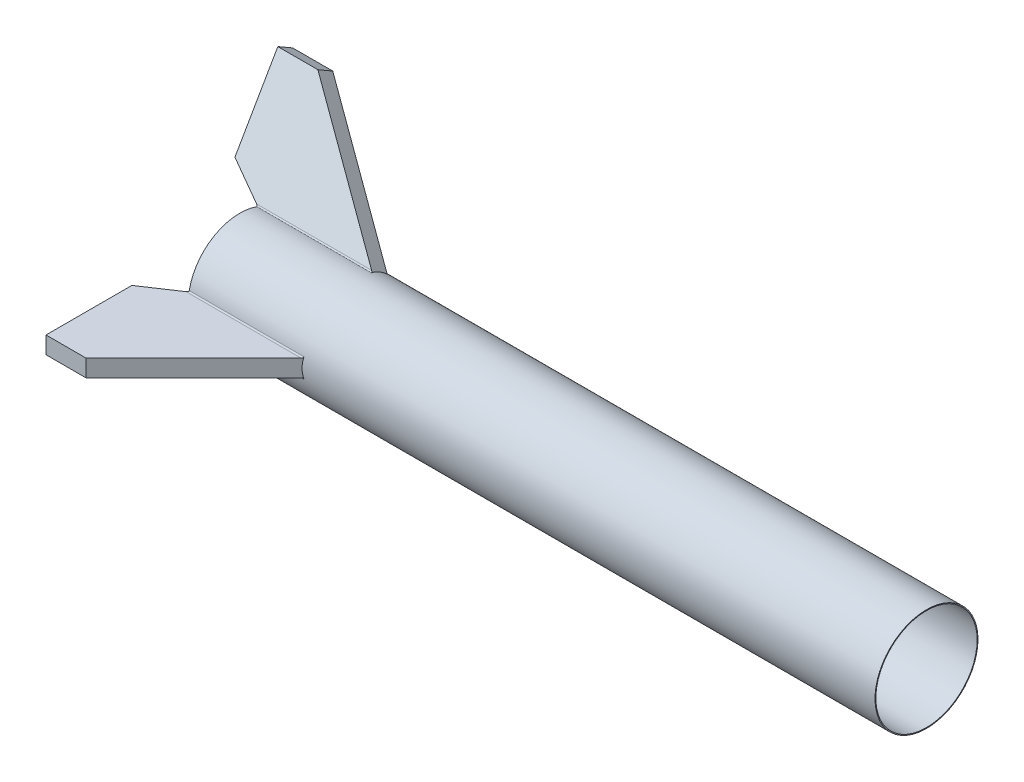
ISO-10303-21;
HEADER;
FILE_DESCRIPTION(('STEP AP214'),'2;1');
FILE_NAME('part.step','',(''),(''),'','','');
FILE_SCHEMA(('AUTOMOTIVE_DESIGN { 1 0 10303 214 1 1 1 1 }'));
ENDSEC;
DATA;
#1=APPLICATION_CONTEXT('core data for automotive mechanical design processes');
#2=APPLICATION_PROTOCOL_DEFINITION('international standard','automotive_design',2000,#1);
#3=PRODUCT_CONTEXT('',#1,'mechanical');
#4=PRODUCT('Part','Part','',(#3));
#5=PRODUCT_RELATED_PRODUCT_CATEGORY('part','',(#4));
#6=PRODUCT_DEFINITION_FORMATION('','',#4);
#7=PRODUCT_DEFINITION_CONTEXT('part definition',#1,'design');
#8=PRODUCT_DEFINITION('design','',#6,#7);
#9=PRODUCT_DEFINITION_SHAPE('','',#8);
#10=(LENGTH_UNIT() NAMED_UNIT(*) SI_UNIT(.MILLI.,.METRE.));
#11=(NAMED_UNIT(*) PLANE_ANGLE_UNIT() SI_UNIT($,.RADIAN.));
#12=(NAMED_UNIT(*) SI_UNIT($,.STERADIAN.) SOLID_ANGLE_UNIT());
#13=UNCERTAINTY_MEASURE_WITH_UNIT(LENGTH_MEASURE(1.E-05),#10,'distance_accuracy_value','');
#14=(GEOMETRIC_REPRESENTATION_CONTEXT(3) GLOBAL_UNCERTAINTY_ASSIGNED_CONTEXT((#13)) GLOBAL_UNIT_ASSIGNED_CONTEXT((#10,
#11,#12)) REPRESENTATION_CONTEXT('',''));
#15=CARTESIAN_POINT('',(0.,0.,0.));
#16=DIRECTION('',(0.,0.,1.));
#17=DIRECTION('',(1.,0.,0.));
#18=AXIS2_PLACEMENT_3D('',#15,#16,#17);
#19=CARTESIAN_POINT('',(-30480.,0.,0.));
#20=DIRECTION('',(1.,0.,0.));
#21=DIRECTION('',(0.,0.,-1.));
#22=AXIS2_PLACEMENT_3D('',#19,#20,#21);
#23=CYLINDRICAL_SURFACE('',#22,4572.);
#24=CARTESIAN_POINT('',(-30480.,0.,0.));
#25=DIRECTION('',(1.,0.,0.));
#26=DIRECTION('',(0.,0.,-1.));
#27=AXIS2_PLACEMENT_3D('',#24,#25,#26);
#28=CIRCLE('',#27,4572.);
#29=CARTESIAN_POINT('',(-30480.,-3455.47625986534,-2993.80490638703));
#30=VERTEX_POINT('',#29);
#31=CARTESIAN_POINT('',(-30480.,3455.47625986538,-2993.80490638698));
#32=VERTEX_POINT('',#31);
#33=EDGE_CURVE('E860',#30,#32,#28,.T.);
#34=ORIENTED_EDGE('',*,*,#33,.T.);
#35=DIRECTION('',(1.,0.,0.));
#36=VECTOR('',#35,1.);
#37=CARTESIAN_POINT('',(-30480.,3455.47625986538,-2993.80490638698));
#38=LINE('',#37,#36);
#39=CARTESIAN_POINT('',(-20301.379881689,3455.47625986538,-2993.80490638698));
#40=VERTEX_POINT('',#39);
#41=EDGE_CURVE('E919',#32,#40,#38,.T.);
#42=ORIENTED_EDGE('',*,*,#41,.T.);
#43=CARTESIAN_POINT('',(-15811.9472052781,0.,0.));
#44=DIRECTION('',(0.707106781186551,0.612372435695794,-0.353553390593266));
#45=DIRECTION('',(0.707106781186544,-0.612372435695801,0.35355339059327));
#46=AXIS2_PLACEMENT_3D('',#43,#44,#45);
#47=ELLIPSE('',#46,6465.78440716975,4572.);
#48=CARTESIAN_POINT('',(-20301.379881689,4320.44923283834,-1495.62777002389));
#49=VERTEX_POINT('',#48);
#50=EDGE_CURVE('E774',#49,#40,#47,.F.);
#51=ORIENTED_EDGE('',*,*,#50,.F.);
#52=DIRECTION('',(1.,0.,0.));
#53=VECTOR('',#52,1.);
#54=CARTESIAN_POINT('',(-30480.,4320.44923283834,-1495.62777002388));
#55=LINE('',#54,#53);
#56=CARTESIAN_POINT('',(-30480.,4320.44923283834,-1495.62777002389));
#57=VERTEX_POINT('',#56);
#58=EDGE_CURVE('E915',#49,#57,#55,.F.);
#59=ORIENTED_EDGE('',*,*,#58,.T.);
#60=CARTESIAN_POINT('',(-30480.,864.972972972973,4489.43267641094));
#61=VERTEX_POINT('',#60);
#62=EDGE_CURVE('E874',#57,#61,#28,.T.);
#63=ORIENTED_EDGE('',*,*,#62,.T.);
#64=DIRECTION('',(1.,0.,0.));
#65=VECTOR('',#64,1.);
#66=CARTESIAN_POINT('',(-30480.,864.972972972973,4489.43267641094));
#67=LINE('',#66,#65);
#68=CARTESIAN_POINT('',(-20301.379881689,864.972972972972,4489.43267641094));
#69=VERTEX_POINT('',#68);
#70=EDGE_CURVE('E849',#61,#69,#67,.T.);
#71=ORIENTED_EDGE('',*,*,#70,.T.);
#72=CARTESIAN_POINT('',(-15811.9472052781,0.,0.));
#73=DIRECTION('',(0.707106781186551,0.,0.707106781186543));
#74=DIRECTION('',(0.707106781186544,0.,-0.707106781186552));
#75=AXIS2_PLACEMENT_3D('',#72,#73,#74);
#76=ELLIPSE('',#75,6465.78440716975,4572.);
#77=CARTESIAN_POINT('',(-20301.379881689,-864.972972972973,4489.43267641094));
#78=VERTEX_POINT('',#77);
#79=EDGE_CURVE('E859',#78,#69,#76,.F.);
#80=ORIENTED_EDGE('',*,*,#79,.F.);
#81=DIRECTION('',(1.,0.,0.));
#82=VECTOR('',#81,1.);
#83=CARTESIAN_POINT('',(-30480.,-864.972972972973,4489.43267641094));
#84=LINE('',#83,#82);
#85=CARTESIAN_POINT('',(-30480.,-864.972972972973,4489.43267641094));
#86=VERTEX_POINT('',#85);
#87=EDGE_CURVE('E852',#78,#86,#84,.F.);
#88=ORIENTED_EDGE('',*,*,#87,.T.);
#89=CARTESIAN_POINT('',(-30480.,-4320.44923283832,-1495.62777002394));
#90=VERTEX_POINT('',#89);
#91=EDGE_CURVE('E855',#86,#90,#28,.T.);
#92=ORIENTED_EDGE('',*,*,#91,.T.);
#93=DIRECTION('',(1.,0.,0.));
#94=VECTOR('',#93,1.);
#95=CARTESIAN_POINT('',(-30480.,-4320.44923283832,-1495.62777002394));
#96=LINE('',#95,#94);
#97=CARTESIAN_POINT('',(-20301.379881689,-4320.44923283832,-1495.62777002394));
#98=VERTEX_POINT('',#97);
#99=EDGE_CURVE('E878',#90,#98,#96,.T.);
#100=ORIENTED_EDGE('',*,*,#99,.T.);
#101=CARTESIAN_POINT('',(-15811.9472052781,0.,0.));
#102=DIRECTION('',(0.707106781186551,-0.612372435695789,-0.353553390593275));
#103=DIRECTION('',(0.707106781186544,0.612372435695796,0.353553390593279));
#104=AXIS2_PLACEMENT_3D('',#101,#102,#103);
#105=ELLIPSE('',#104,6465.78440716975,4572.);
#106=CARTESIAN_POINT('',(-20301.379881689,-3455.47625986534,-2993.80490638703));
#107=VERTEX_POINT('',#106);
#108=EDGE_CURVE('E801',#107,#98,#105,.F.);
#109=ORIENTED_EDGE('',*,*,#108,.F.);
#110=DIRECTION('',(1.,0.,0.));
#111=VECTOR('',#110,1.);
#112=CARTESIAN_POINT('',(-30480.,-3455.47625986534,-2993.80490638703));
#113=LINE('',#112,#111);
#114=EDGE_CURVE('E876',#107,#30,#113,.F.);
#115=ORIENTED_EDGE('',*,*,#114,.T.);
#116=EDGE_LOOP('',(#34,#42,#51,#59,#63,#71,#80,#88,#92,#100,#109,#115));
#117=FACE_BOUND('',#116,.T.);
#118=CARTESIAN_POINT('',(30480.,0.,0.));
#119=DIRECTION('',(1.,0.,0.));
#120=DIRECTION('',(0.,0.,-1.));
#121=AXIS2_PLACEMENT_3D('',#118,#119,#120);
#122=CIRCLE('',#121,4572.);
#123=CARTESIAN_POINT('',(30480.,0.,-4572.));
#124=VERTEX_POINT('',#123);
#125=EDGE_CURVE('E865',#124,#124,#122,.T.);
#126=ORIENTED_EDGE('',*,*,#125,.F.);
#127=EDGE_LOOP('',(#126));
#128=FACE_BOUND('',#127,.T.);
#129=ADVANCED_FACE('F89',(#117,#128),#23,.T.);
#130=CARTESIAN_POINT('',(-30480.,0.,0.));
#131=DIRECTION('',(1.,0.,0.));
#132=DIRECTION('',(0.,0.,-1.));
#133=AXIS2_PLACEMENT_3D('',#130,#131,#132);
#134=PLANE('',#133);
#135=CARTESIAN_POINT('',(-30480.,0.,0.));
#136=DIRECTION('',(1.,0.,0.));
#137=DIRECTION('',(0.,0.,-1.));
#138=AXIS2_PLACEMENT_3D('',#135,#136,#137);
#139=CIRCLE('',#138,4495.8);
#140=CARTESIAN_POINT('',(-30480.,0.,-4495.8));
#141=VERTEX_POINT('',#140);
#142=EDGE_CURVE('E1194',#141,#141,#139,.T.);
#143=ORIENTED_EDGE('',*,*,#142,.T.);
#144=EDGE_LOOP('',(#143));
#145=FACE_BOUND('',#144,.T.);
#146=ORIENTED_EDGE('',*,*,#62,.F.);
#147=CARTESIAN_POINT('',(-30480.,4440.46171152829,-1537.17298585788));
#148=DIRECTION('',(1.,0.,0.));
#149=DIRECTION('',(0.,0.,-1.));
#150=AXIS2_PLACEMENT_3D('',#147,#148,#149);
#151=CIRCLE('',#150,127.);
#152=CARTESIAN_POINT('',(-30480.,4313.67876095168,-1544.59480794472));
#153=VERTEX_POINT('',#152);
#154=EDGE_CURVE('E105',#57,#153,#151,.T.);
#155=ORIENTED_EDGE('',*,*,#154,.T.);
#156=DIRECTION('',(0.,0.499999999999992,0.866025403784443));
#157=VECTOR('',#156,1.);
#158=CARTESIAN_POINT('',(-30480.,3904.08824183063,-2254.02639736092));
#159=LINE('',#158,#157);
#160=CARTESIAN_POINT('',(-30480.,4285.08824183062,-1594.11503967717));
#161=VERTEX_POINT('',#160);
#162=EDGE_CURVE('E13',#161,#153,#159,.T.);
#163=ORIENTED_EDGE('',*,*,#162,.F.);
#164=DIRECTION('',(0.,0.499999999999992,0.866025403784443));
#165=VECTOR('',#164,1.);
#166=CARTESIAN_POINT('',(-30480.,3523.08824183063,-2913.93775504466));
#167=LINE('',#166,#165);
#168=CARTESIAN_POINT('',(-30480.,3523.08824183062,-2913.93775504468));
#169=VERTEX_POINT('',#168);
#170=EDGE_CURVE('E499',#169,#161,#167,.T.);
#171=ORIENTED_EDGE('',*,*,#170,.F.);
#172=DIRECTION('',(0.,-0.499999999999992,-0.866025403784443));
#173=VECTOR('',#172,1.);
#174=CARTESIAN_POINT('',(-30480.,3904.08824183062,-2254.02639736092));
#175=LINE('',#174,#173);
#176=CARTESIAN_POINT('',(-30480.,3494.49772270957,-2963.45798677711));
#177=VERTEX_POINT('',#176);
#178=EDGE_CURVE('E98',#169,#177,#175,.T.);
#179=ORIENTED_EDGE('',*,*,#178,.T.);
#180=CARTESIAN_POINT('',(-30480.,3551.4617115283,-3076.96615378662));
#181=DIRECTION('',(1.,0.,0.));
#182=DIRECTION('',(0.,0.,-1.));
#183=AXIS2_PLACEMENT_3D('',#180,#181,#182);
#184=CIRCLE('',#183,127.);
#185=EDGE_CURVE('E927',#177,#32,#184,.T.);
#186=ORIENTED_EDGE('',*,*,#185,.T.);
#187=ORIENTED_EDGE('',*,*,#33,.F.);
#188=CARTESIAN_POINT('',(-30480.,-3551.46171152826,-3076.96615378667));
#189=DIRECTION('',(1.,0.,0.));
#190=DIRECTION('',(0.,0.,-1.));
#191=AXIS2_PLACEMENT_3D('',#188,#189,#190);
#192=CIRCLE('',#191,127.);
#193=CARTESIAN_POINT('',(-30480.,-3494.49772270952,-2963.45798677716));
#194=VERTEX_POINT('',#193);
#195=EDGE_CURVE('E897',#30,#194,#192,.T.);
#196=ORIENTED_EDGE('',*,*,#195,.T.);
#197=DIRECTION('',(0.,0.500000000000004,-0.866025403784436));
#198=VECTOR('',#197,1.);
#199=CARTESIAN_POINT('',(-30480.,-3904.08824183059,-2254.02639736097));
#200=LINE('',#199,#198);
#201=CARTESIAN_POINT('',(-30480.,-3523.08824183059,-2913.93775504471));
#202=VERTEX_POINT('',#201);
#203=EDGE_CURVE('E908',#202,#194,#200,.T.);
#204=ORIENTED_EDGE('',*,*,#203,.F.);
#205=DIRECTION('',(0.,0.500000000000004,-0.866025403784436));
#206=VECTOR('',#205,1.);
#207=CARTESIAN_POINT('',(-30480.,-4285.0882418306,-1594.11503967723));
#208=LINE('',#207,#206);
#209=CARTESIAN_POINT('',(-30480.,-4285.08824183061,-1594.11503967719));
#210=VERTEX_POINT('',#209);
#211=EDGE_CURVE('E716',#210,#202,#208,.T.);
#212=ORIENTED_EDGE('',*,*,#211,.F.);
#213=DIRECTION('',(0.,-0.500000000000004,0.866025403784436));
#214=VECTOR('',#213,1.);
#215=CARTESIAN_POINT('',(-30480.,-3904.08824183059,-2254.02639736097));
#216=LINE('',#215,#214);
#217=CARTESIAN_POINT('',(-30480.,-4313.67876095166,-1544.59480794477));
#218=VERTEX_POINT('',#217);
#219=EDGE_CURVE('E903',#210,#218,#216,.T.);
#220=ORIENTED_EDGE('',*,*,#219,.T.);
#221=CARTESIAN_POINT('',(-30480.,-4440.46171152827,-1537.17298585794));
#222=DIRECTION('',(1.,0.,0.));
#223=DIRECTION('',(0.,0.,-1.));
#224=AXIS2_PLACEMENT_3D('',#221,#222,#223);
#225=CIRCLE('',#224,127.);
#226=EDGE_CURVE('E887',#218,#90,#225,.T.);
#227=ORIENTED_EDGE('',*,*,#226,.T.);
#228=ORIENTED_EDGE('',*,*,#91,.F.);
#229=CARTESIAN_POINT('',(-30480.,-888.999999999999,4614.13913964458));
#230=DIRECTION('',(1.,0.,0.));
#231=DIRECTION('',(0.,0.,-1.));
#232=AXIS2_PLACEMENT_3D('',#229,#230,#231);
#233=CIRCLE('',#232,127.);
#234=CARTESIAN_POINT('',(-30480.,-819.181038242123,4508.0527947219));
#235=VERTEX_POINT('',#234);
#236=EDGE_CURVE('E826',#86,#235,#233,.T.);
#237=ORIENTED_EDGE('',*,*,#236,.T.);
#238=DIRECTION('',(0.,-1.,0.));
#239=VECTOR('',#238,1.);
#240=CARTESIAN_POINT('',(-30480.,0.,4508.0527947219));
#241=LINE('',#240,#239);
#242=CARTESIAN_POINT('',(-30480.,-762.,4508.05279472191));
#243=VERTEX_POINT('',#242);
#244=EDGE_CURVE('E807',#243,#235,#241,.T.);
#245=ORIENTED_EDGE('',*,*,#244,.F.);
#246=DIRECTION('',(0.,-1.,0.));
#247=VECTOR('',#246,1.);
#248=CARTESIAN_POINT('',(-30480.,762.,4508.05279472191));
#249=LINE('',#248,#247);
#250=CARTESIAN_POINT('',(-30480.,762.000000000028,4508.0527947219));
#251=VERTEX_POINT('',#250);
#252=EDGE_CURVE('E973',#251,#243,#249,.T.);
#253=ORIENTED_EDGE('',*,*,#252,.F.);
#254=DIRECTION('',(0.,1.,0.));
#255=VECTOR('',#254,1.);
#256=CARTESIAN_POINT('',(-30480.,0.,4508.0527947219));
#257=LINE('',#256,#255);
#258=CARTESIAN_POINT('',(-30480.,819.181038242125,4508.0527947219));
#259=VERTEX_POINT('',#258);
#260=EDGE_CURVE('E811',#251,#259,#257,.T.);
#261=ORIENTED_EDGE('',*,*,#260,.T.);
#262=CARTESIAN_POINT('',(-30480.,889.,4614.13913964458));
#263=DIRECTION('',(1.,0.,0.));
#264=DIRECTION('',(0.,0.,-1.));
#265=AXIS2_PLACEMENT_3D('',#262,#263,#264);
#266=CIRCLE('',#265,127.);
#267=EDGE_CURVE('E837',#259,#61,#266,.T.);
#268=ORIENTED_EDGE('',*,*,#267,.T.);
#269=EDGE_LOOP('',(#146,#155,#163,#171,#179,#186,#187,#196,#204,#212,#220,#227,#228,#237,#245,
#253,#261,#268));
#270=FACE_BOUND('',#269,.T.);
#271=ADVANCED_FACE('F775',(#145,#270),#134,.F.);
#272=CARTESIAN_POINT('',(30480.,0.,0.));
#273=DIRECTION('',(1.,0.,0.));
#274=DIRECTION('',(0.,0.,-1.));
#275=AXIS2_PLACEMENT_3D('',#272,#273,#274);
#276=PLANE('',#275);
#277=CARTESIAN_POINT('',(30480.,0.,0.));
#278=DIRECTION('',(1.,0.,0.));
#279=DIRECTION('',(0.,0.,-1.));
#280=AXIS2_PLACEMENT_3D('',#277,#278,#279);
#281=CIRCLE('',#280,4495.8);
#282=CARTESIAN_POINT('',(30480.,0.,-4495.8));
#283=VERTEX_POINT('',#282);
#284=EDGE_CURVE('E977',#283,#283,#281,.T.);
#285=ORIENTED_EDGE('',*,*,#284,.F.);
#286=EDGE_LOOP('',(#285));
#287=FACE_BOUND('',#286,.T.);
#288=ORIENTED_EDGE('',*,*,#125,.T.);
#289=EDGE_LOOP('',(#288));
#290=FACE_BOUND('',#289,.T.);
#291=ADVANCED_FACE('F785',(#287,#290),#276,.T.);
#292=CARTESIAN_POINT('',(-30480.,0.,0.));
#293=DIRECTION('',(1.,0.,0.));
#294=DIRECTION('',(0.,0.,-1.));
#295=AXIS2_PLACEMENT_3D('',#292,#293,#294);
#296=CYLINDRICAL_SURFACE('',#295,4495.8);
#297=ORIENTED_EDGE('',*,*,#142,.F.);
#298=EDGE_LOOP('',(#297));
#299=FACE_BOUND('',#298,.T.);
#300=ORIENTED_EDGE('',*,*,#284,.T.);
#301=EDGE_LOOP('',(#300));
#302=FACE_BOUND('',#301,.T.);
#303=ADVANCED_FACE('F1043',(#299,#302),#296,.F.);
#304=CARTESIAN_POINT('',(-33528.,0.,0.));
#305=DIRECTION('',(-1.,0.,0.));
#306=DIRECTION('',(0.,0.,1.));
#307=AXIS2_PLACEMENT_3D('',#304,#305,#306);
#308=PLANE('',#307);
#309=DIRECTION('',(0.,-1.,0.));
#310=VECTOR('',#309,1.);
#311=CARTESIAN_POINT('',(-33528.,762.,6540.05279472191));
#312=LINE('',#311,#310);
#313=CARTESIAN_POINT('',(-33528.,762.,6540.05279472191));
#314=VERTEX_POINT('',#313);
#315=CARTESIAN_POINT('',(-33528.,-762.,6540.05279472191));
#316=VERTEX_POINT('',#315);
#317=EDGE_CURVE('E767',#314,#316,#312,.T.);
#318=ORIENTED_EDGE('',*,*,#317,.T.);
#319=DIRECTION('',(0.,0.,1.));
#320=VECTOR('',#319,1.);
#321=CARTESIAN_POINT('',(-33528.,-762.,6540.05279472191));
#322=LINE('',#321,#320);
#323=CARTESIAN_POINT('',(-33528.,-762.,14160.0527947219));
#324=VERTEX_POINT('',#323);
#325=EDGE_CURVE('E1135',#316,#324,#322,.T.);
#326=ORIENTED_EDGE('',*,*,#325,.T.);
#327=DIRECTION('',(0.,1.,0.));
#328=VECTOR('',#327,1.);
#329=CARTESIAN_POINT('',(-33528.,762.,14160.0527947219));
#330=LINE('',#329,#328);
#331=CARTESIAN_POINT('',(-33528.,762.,14160.0527947219));
#332=VERTEX_POINT('',#331);
#333=EDGE_CURVE('E1126',#324,#332,#330,.T.);
#334=ORIENTED_EDGE('',*,*,#333,.T.);
#335=DIRECTION('',(0.,0.,-1.));
#336=VECTOR('',#335,1.);
#337=CARTESIAN_POINT('',(-33528.,762.,6540.05279472191));
#338=LINE('',#337,#336);
#339=EDGE_CURVE('E1115',#332,#314,#338,.T.);
#340=ORIENTED_EDGE('',*,*,#339,.T.);
#341=EDGE_LOOP('',(#318,#326,#334,#340));
#342=FACE_BOUND('',#341,.T.);
#343=ADVANCED_FACE('F613',(#342),#308,.T.);
#344=CARTESIAN_POINT('',(0.,762.,0.));
#345=DIRECTION('',(0.,1.,0.));
#346=DIRECTION('',(0.,0.,1.));
#347=AXIS2_PLACEMENT_3D('',#344,#345,#346);
#348=PLANE('',#347);
#349=CARTESIAN_POINT('',(-29971.9999999999,762.,14160.0527947219));
#350=DIRECTION('',(0.707106781186543,0.,-0.707106781186552));
#351=VECTOR('',#350,1.);
#352=LINE('',#349,#351);
#353=CARTESIAN_POINT('',(-29971.9999999999,762.,14160.0527947219));
#354=VERTEX_POINT('',#353);
#355=CARTESIAN_POINT('',(-20426.0863449227,762.,4614.13913964458));
#356=VERTEX_POINT('',#355);
#357=EDGE_CURVE('E1071',#354,#356,#352,.T.);
#358=ORIENTED_EDGE('',*,*,#357,.T.);
#359=DIRECTION('',(-1.,0.,0.));
#360=VECTOR('',#359,1.);
#361=CARTESIAN_POINT('',(-30480.,762.,4614.13913964458));
#362=LINE('',#361,#360);
#363=CARTESIAN_POINT('',(-30639.129517384,762.,4614.13913964458));
#364=VERTEX_POINT('',#363);
#365=EDGE_CURVE('E854',#356,#364,#362,.T.);
#366=ORIENTED_EDGE('',*,*,#365,.T.);
#367=CARTESIAN_POINT('',(-33528.,762.,6540.05279472191));
#368=DIRECTION('',(0.832050294337843,0.,-0.55470019622523));
#369=VECTOR('',#368,1.);
#370=LINE('',#367,#369);
#371=EDGE_CURVE('E1064',#314,#364,#370,.T.);
#372=ORIENTED_EDGE('',*,*,#371,.F.);
#373=ORIENTED_EDGE('',*,*,#339,.F.);
#374=CARTESIAN_POINT('',(-33528.,762.,14160.0527947219));
#375=DIRECTION('',(1.,0.,0.));
#376=VECTOR('',#375,1.);
#377=LINE('',#374,#376);
#378=EDGE_CURVE('E1083',#332,#354,#377,.T.);
#379=ORIENTED_EDGE('',*,*,#378,.T.);
#380=EDGE_LOOP('',(#358,#366,#372,#373,#379));
#381=FACE_BOUND('',#380,.T.);
#382=ADVANCED_FACE('F1000',(#381),#348,.T.);
#383=CARTESIAN_POINT('',(-7297.82178705144,0.,-10946.7326805771));
#384=DIRECTION('',(-0.554700196225229,0.,-0.832050294337844));
#385=DIRECTION('',(-0.832050294337844,0.,0.554700196225229));
#386=AXIS2_PLACEMENT_3D('',#383,#384,#385);
#387=PLANE('',#386);
#388=ORIENTED_EDGE('',*,*,#371,.T.);
#389=CARTESIAN_POINT('',(-30639.129517384,889.,4614.13913964458));
#390=DIRECTION('',(-0.554700196225229,0.,-0.832050294337844));
#391=DIRECTION('',(0.832050294337844,0.,-0.554700196225229));
#392=AXIS2_PLACEMENT_3D('',#389,#390,#391);
#393=ELLIPSE('',#392,228.952505991963,127.);
#394=EDGE_CURVE('E840',#364,#259,#393,.F.);
#395=ORIENTED_EDGE('',*,*,#394,.T.);
#396=ORIENTED_EDGE('',*,*,#260,.F.);
#397=ORIENTED_EDGE('',*,*,#252,.T.);
#398=ORIENTED_EDGE('',*,*,#244,.T.);
#399=CARTESIAN_POINT('',(-30639.129517384,-888.999999999999,4614.13913964458));
#400=DIRECTION('',(-0.554700196225229,0.,-0.832050294337844));
#401=DIRECTION('',(0.832050294337844,0.,-0.554700196225229));
#402=AXIS2_PLACEMENT_3D('',#399,#400,#401);
#403=ELLIPSE('',#402,228.952505991963,127.);
#404=CARTESIAN_POINT('',(-30639.129517384,-762.,4614.13913964458));
#405=VERTEX_POINT('',#404);
#406=EDGE_CURVE('E817',#235,#405,#403,.F.);
#407=ORIENTED_EDGE('',*,*,#406,.T.);
#408=CARTESIAN_POINT('',(-33528.,-762.,6540.05279472191));
#409=DIRECTION('',(0.832050294337843,0.,-0.55470019622523));
#410=VECTOR('',#409,1.);
#411=LINE('',#408,#410);
#412=EDGE_CURVE('E978',#316,#405,#411,.T.);
#413=ORIENTED_EDGE('',*,*,#412,.F.);
#414=ORIENTED_EDGE('',*,*,#317,.F.);
#415=EDGE_LOOP('',(#388,#395,#396,#397,#398,#407,#413,#414));
#416=FACE_BOUND('',#415,.T.);
#417=ADVANCED_FACE('F976',(#416),#387,.T.);
#418=CARTESIAN_POINT('',(-29971.9999999999,762.,14160.0527947219));
#419=DIRECTION('',(0.707106781186551,0.,0.707106781186543));
#420=DIRECTION('',(0.,-1.,0.));
#421=AXIS2_PLACEMENT_3D('',#418,#419,#420);
#422=PLANE('',#421);
#423=CARTESIAN_POINT('',(-29971.9999999999,-762.000000000001,14160.0527947219));
#424=DIRECTION('',(0.707106781186543,0.,-0.707106781186552));
#425=VECTOR('',#424,1.);
#426=LINE('',#423,#425);
#427=CARTESIAN_POINT('',(-29971.9999999999,-762.000000000001,14160.0527947219));
#428=VERTEX_POINT('',#427);
#429=CARTESIAN_POINT('',(-20426.0863449227,-762.,4614.13913964458));
#430=VERTEX_POINT('',#429);
#431=EDGE_CURVE('E1095',#428,#430,#426,.T.);
#432=ORIENTED_EDGE('',*,*,#431,.T.);
#433=CARTESIAN_POINT('',(-20426.0863449227,-888.999999999999,4614.13913964458));
#434=DIRECTION('',(0.707106781186551,0.,0.707106781186543));
#435=DIRECTION('',(0.707106781186544,0.,-0.707106781186552));
#436=AXIS2_PLACEMENT_3D('',#433,#434,#435);
#437=ELLIPSE('',#436,179.605122421382,127.);
#438=EDGE_CURVE('E828',#430,#78,#437,.F.);
#439=ORIENTED_EDGE('',*,*,#438,.T.);
#440=ORIENTED_EDGE('',*,*,#79,.T.);
#441=CARTESIAN_POINT('',(-20426.0863449227,889.,4614.13913964458));
#442=DIRECTION('',(0.707106781186551,0.,0.707106781186543));
#443=DIRECTION('',(0.707106781186544,0.,-0.707106781186552));
#444=AXIS2_PLACEMENT_3D('',#441,#442,#443);
#445=ELLIPSE('',#444,179.605122421382,127.);
#446=EDGE_CURVE('E833',#69,#356,#445,.F.);
#447=ORIENTED_EDGE('',*,*,#446,.T.);
#448=ORIENTED_EDGE('',*,*,#357,.F.);
#449=DIRECTION('',(0.,-1.,0.));
#450=VECTOR('',#449,1.);
#451=CARTESIAN_POINT('',(-29971.9999999999,-6.66133814775094E-13,14160.0527947219));
#452=LINE('',#451,#450);
#453=EDGE_CURVE('E1056',#354,#428,#452,.T.);
#454=ORIENTED_EDGE('',*,*,#453,.T.);
#455=EDGE_LOOP('',(#432,#439,#440,#447,#448,#454));
#456=FACE_BOUND('',#455,.T.);
#457=ADVANCED_FACE('F999',(#456),#422,.T.);
#458=CARTESIAN_POINT('',(-33528.,762.,14160.0527947219));
#459=DIRECTION('',(0.,0.,1.));
#460=DIRECTION('',(0.,-1.,0.));
#461=AXIS2_PLACEMENT_3D('',#458,#459,#460);
#462=PLANE('',#461);
#463=ORIENTED_EDGE('',*,*,#333,.F.);
#464=CARTESIAN_POINT('',(-33528.,-761.999999999999,14160.0527947219));
#465=DIRECTION('',(1.,0.,0.));
#466=VECTOR('',#465,1.);
#467=LINE('',#464,#466);
#468=EDGE_CURVE('E1025',#324,#428,#467,.T.);
#469=ORIENTED_EDGE('',*,*,#468,.T.);
#470=ORIENTED_EDGE('',*,*,#453,.F.);
#471=ORIENTED_EDGE('',*,*,#378,.F.);
#472=EDGE_LOOP('',(#463,#469,#470,#471));
#473=FACE_BOUND('',#472,.T.);
#474=ADVANCED_FACE('F1041',(#473),#462,.T.);
#475=CARTESIAN_POINT('',(0.,-761.999999999999,0.));
#476=DIRECTION('',(0.,-1.,0.));
#477=DIRECTION('',(1.,0.,0.));
#478=AXIS2_PLACEMENT_3D('',#475,#476,#477);
#479=PLANE('',#478);
#480=ORIENTED_EDGE('',*,*,#412,.T.);
#481=DIRECTION('',(-1.,0.,0.));
#482=VECTOR('',#481,1.);
#483=CARTESIAN_POINT('',(-20320.,-761.999999999999,4614.13913964458));
#484=LINE('',#483,#482);
#485=EDGE_CURVE('E844',#405,#430,#484,.F.);
#486=ORIENTED_EDGE('',*,*,#485,.T.);
#487=ORIENTED_EDGE('',*,*,#431,.F.);
#488=ORIENTED_EDGE('',*,*,#468,.F.);
#489=ORIENTED_EDGE('',*,*,#325,.F.);
#490=EDGE_LOOP('',(#480,#486,#487,#488,#489));
#491=FACE_BOUND('',#490,.T.);
#492=ADVANCED_FACE('F1032',(#491),#479,.T.);
#493=CARTESIAN_POINT('',(-30480.,889.,4614.13913964458));
#494=DIRECTION('',(1.,0.,0.));
#495=DIRECTION('',(0.,0.,-1.));
#496=AXIS2_PLACEMENT_3D('',#493,#494,#495);
#497=CYLINDRICAL_SURFACE('',#496,127.);
#498=ORIENTED_EDGE('',*,*,#446,.F.);
#499=ORIENTED_EDGE('',*,*,#70,.F.);
#500=ORIENTED_EDGE('',*,*,#267,.F.);
#501=ORIENTED_EDGE('',*,*,#394,.F.);
#502=ORIENTED_EDGE('',*,*,#365,.F.);
#503=EDGE_LOOP('',(#498,#499,#500,#501,#502));
#504=FACE_BOUND('',#503,.T.);
#505=ADVANCED_FACE('F1040',(#504),#497,.F.);
#506=CARTESIAN_POINT('',(-30480.,-888.999999999999,4614.13913964458));
#507=DIRECTION('',(1.,0.,0.));
#508=DIRECTION('',(0.,0.,-1.));
#509=AXIS2_PLACEMENT_3D('',#506,#507,#508);
#510=CYLINDRICAL_SURFACE('',#509,127.);
#511=ORIENTED_EDGE('',*,*,#236,.F.);
#512=ORIENTED_EDGE('',*,*,#87,.F.);
#513=ORIENTED_EDGE('',*,*,#438,.F.);
#514=ORIENTED_EDGE('',*,*,#485,.F.);
#515=ORIENTED_EDGE('',*,*,#406,.F.);
#516=EDGE_LOOP('',(#511,#512,#513,#514,#515));
#517=FACE_BOUND('',#516,.T.);
#518=ADVANCED_FACE('F971',(#517),#510,.F.);
#519=CARTESIAN_POINT('',(-33528.,0.,0.));
#520=DIRECTION('',(-1.,0.,0.));
#521=DIRECTION('',(0.,-0.866025403784436,-0.500000000000004));
#522=AXIS2_PLACEMENT_3D('',#519,#520,#521);
#523=PLANE('',#522);
#524=DIRECTION('',(0.,0.500000000000004,-0.866025403784436));
#525=VECTOR('',#524,1.);
#526=CARTESIAN_POINT('',(-33528.,-6044.85186232057,-2610.11503967724));
#527=LINE('',#526,#525);
#528=CARTESIAN_POINT('',(-33528.,-6044.85186232057,-2610.11503967724));
#529=VERTEX_POINT('',#528);
#530=CARTESIAN_POINT('',(-33528.,-5282.85186232057,-3929.93775504472));
#531=VERTEX_POINT('',#530);
#532=EDGE_CURVE('E509',#529,#531,#527,.T.);
#533=ORIENTED_EDGE('',*,*,#532,.T.);
#534=DIRECTION('',(0.,-0.866025403784436,-0.500000000000004));
#535=VECTOR('',#534,1.);
#536=CARTESIAN_POINT('',(-33528.,-5282.85186232057,-3929.93775504472));
#537=LINE('',#536,#535);
#538=CARTESIAN_POINT('',(-33528.,-11881.965439158,-7739.93775504475));
#539=VERTEX_POINT('',#538);
#540=EDGE_CURVE('E512',#531,#539,#537,.T.);
#541=ORIENTED_EDGE('',*,*,#540,.T.);
#542=DIRECTION('',(0.,-0.500000000000004,0.866025403784436));
#543=VECTOR('',#542,1.);
#544=CARTESIAN_POINT('',(-33528.,-12643.965439158,-6420.11503967727));
#545=LINE('',#544,#543);
#546=CARTESIAN_POINT('',(-33528.,-12643.965439158,-6420.11503967727));
#547=VERTEX_POINT('',#546);
#548=EDGE_CURVE('E686',#539,#547,#545,.T.);
#549=ORIENTED_EDGE('',*,*,#548,.T.);
#550=DIRECTION('',(0.,0.866025403784436,0.500000000000004));
#551=VECTOR('',#550,1.);
#552=CARTESIAN_POINT('',(-33528.,-6044.85186232057,-2610.11503967724));
#553=LINE('',#552,#551);
#554=EDGE_CURVE('E675',#547,#529,#553,.T.);
#555=ORIENTED_EDGE('',*,*,#554,.T.);
#556=EDGE_LOOP('',(#533,#541,#549,#555));
#557=FACE_BOUND('',#556,.T.);
#558=ADVANCED_FACE('F380',(#557),#523,.T.);
#559=CARTESIAN_POINT('',(0.,-381.000000000003,659.911357683741));
#560=DIRECTION('',(0.,-0.500000000000004,0.866025403784436));
#561=DIRECTION('',(0.,-0.866025403784436,-0.500000000000004));
#562=AXIS2_PLACEMENT_3D('',#559,#560,#561);
#563=PLANE('',#562);
#564=CARTESIAN_POINT('',(-29971.9999999999,-12643.965439158,-6420.11503967727));
#565=DIRECTION('',(0.707106781186544,0.612372435695796,0.353553390593279));
#566=VECTOR('',#565,1.);
#567=LINE('',#564,#566);
#568=CARTESIAN_POINT('',(-29971.9999999999,-12643.965439158,-6420.11503967727));
#569=VERTEX_POINT('',#568);
#570=CARTESIAN_POINT('',(-20426.0863449227,-4376.96171152828,-1647.15821213857));
#571=VERTEX_POINT('',#570);
#572=EDGE_CURVE('E640',#569,#571,#567,.T.);
#573=ORIENTED_EDGE('',*,*,#572,.T.);
#574=DIRECTION('',(-1.,0.,0.));
#575=VECTOR('',#574,1.);
#576=CARTESIAN_POINT('',(-30480.,-4376.96171152827,-1647.15821213857));
#577=LINE('',#576,#575);
#578=CARTESIAN_POINT('',(-30639.129517384,-4376.96171152828,-1647.15821213857));
#579=VERTEX_POINT('',#578);
#580=EDGE_CURVE('E520',#571,#579,#577,.T.);
#581=ORIENTED_EDGE('',*,*,#580,.T.);
#582=CARTESIAN_POINT('',(-33528.,-6044.85186232058,-2610.11503967724));
#583=DIRECTION('',(0.832050294337843,0.480384461415261,0.277350098112617));
#584=VECTOR('',#583,1.);
#585=LINE('',#582,#584);
#586=EDGE_CURVE('E532',#529,#579,#585,.T.);
#587=ORIENTED_EDGE('',*,*,#586,.F.);
#588=ORIENTED_EDGE('',*,*,#554,.F.);
#589=CARTESIAN_POINT('',(-33528.,-12643.965439158,-6420.11503967727));
#590=DIRECTION('',(1.,0.,0.));
#591=VECTOR('',#590,1.);
#592=LINE('',#589,#591);
#593=EDGE_CURVE('E732',#547,#569,#592,.T.);
#594=ORIENTED_EDGE('',*,*,#593,.T.);
#595=EDGE_LOOP('',(#573,#581,#587,#588,#594));
#596=FACE_BOUND('',#595,.T.);
#597=ADVANCED_FACE('F538',(#596),#563,.T.);
#598=CARTESIAN_POINT('',(-7297.82178705144,9480.14858981711,5473.36634028862));
#599=DIRECTION('',(-0.554700196225229,0.72057669212289,0.416025147168925));
#600=DIRECTION('',(-0.832050294337844,-0.48038446141526,-0.277350098112617));
#601=AXIS2_PLACEMENT_3D('',#598,#599,#600);
#602=PLANE('',#601);
#603=ORIENTED_EDGE('',*,*,#586,.T.);
#604=CARTESIAN_POINT('',(-30639.129517384,-4440.46171152827,-1537.17298585794));
#605=DIRECTION('',(-0.554700196225229,0.72057669212289,0.416025147168925));
#606=DIRECTION('',(0.832050294337844,0.48038446141526,0.277350098112617));
#607=AXIS2_PLACEMENT_3D('',#604,#605,#606);
#608=ELLIPSE('',#607,228.952505991963,127.);
#609=EDGE_CURVE('E883',#579,#218,#608,.F.);
#610=ORIENTED_EDGE('',*,*,#609,.T.);
#611=ORIENTED_EDGE('',*,*,#219,.F.);
#612=ORIENTED_EDGE('',*,*,#211,.T.);
#613=ORIENTED_EDGE('',*,*,#203,.T.);
#614=CARTESIAN_POINT('',(-30639.129517384,-3551.46171152826,-3076.96615378667));
#615=DIRECTION('',(-0.554700196225229,0.72057669212289,0.416025147168925));
#616=DIRECTION('',(0.832050294337844,0.48038446141526,0.277350098112617));
#617=AXIS2_PLACEMENT_3D('',#614,#615,#616);
#618=ELLIPSE('',#617,228.952505991963,127.);
#619=CARTESIAN_POINT('',(-30639.129517384,-3614.96171152826,-2966.98092750605));
#620=VERTEX_POINT('',#619);
#621=EDGE_CURVE('E901',#194,#620,#618,.F.);
#622=ORIENTED_EDGE('',*,*,#621,.T.);
#623=CARTESIAN_POINT('',(-33528.,-5282.85186232057,-3929.93775504472));
#624=DIRECTION('',(0.832050294337843,0.48038446141526,0.277350098112617));
#625=VECTOR('',#624,1.);
#626=LINE('',#623,#625);
#627=EDGE_CURVE('E572',#531,#620,#626,.T.);
#628=ORIENTED_EDGE('',*,*,#627,.F.);
#629=ORIENTED_EDGE('',*,*,#532,.F.);
#630=EDGE_LOOP('',(#603,#610,#611,#612,#613,#622,#628,#629));
#631=FACE_BOUND('',#630,.T.);
#632=ADVANCED_FACE('F547',(#631),#602,.T.);
#633=CARTESIAN_POINT('',(-29971.9999999999,-12643.965439158,-6420.11503967727));
#634=DIRECTION('',(0.707106781186551,-0.612372435695789,-0.353553390593275));
#635=DIRECTION('',(0.,0.500000000000004,-0.866025403784436));
#636=AXIS2_PLACEMENT_3D('',#633,#634,#635);
#637=PLANE('',#636);
#638=CARTESIAN_POINT('',(-29971.9999999999,-11881.965439158,-7739.93775504475));
#639=DIRECTION('',(0.707106781186543,0.612372435695796,0.353553390593279));
#640=VECTOR('',#639,1.);
#641=LINE('',#638,#640);
#642=CARTESIAN_POINT('',(-29971.9999999999,-11881.965439158,-7739.93775504475));
#643=VERTEX_POINT('',#642);
#644=CARTESIAN_POINT('',(-20426.0863449227,-3614.96171152826,-2966.98092750605));
#645=VERTEX_POINT('',#644);
#646=EDGE_CURVE('E961',#643,#645,#641,.T.);
#647=ORIENTED_EDGE('',*,*,#646,.T.);
#648=CARTESIAN_POINT('',(-20426.0863449227,-3551.46171152826,-3076.96615378667));
#649=DIRECTION('',(0.707106781186551,-0.612372435695789,-0.353553390593275));
#650=DIRECTION('',(0.707106781186544,0.612372435695796,0.353553390593279));
#651=AXIS2_PLACEMENT_3D('',#648,#649,#650);
#652=ELLIPSE('',#651,179.605122421382,127.);
#653=EDGE_CURVE('E893',#645,#107,#652,.F.);
#654=ORIENTED_EDGE('',*,*,#653,.T.);
#655=ORIENTED_EDGE('',*,*,#108,.T.);
#656=CARTESIAN_POINT('',(-20426.0863449227,-4440.46171152827,-1537.17298585794));
#657=DIRECTION('',(0.707106781186551,-0.612372435695789,-0.353553390593275));
#658=DIRECTION('',(0.707106781186544,0.612372435695796,0.353553390593279));
#659=AXIS2_PLACEMENT_3D('',#656,#657,#658);
#660=ELLIPSE('',#659,179.605122421382,127.);
#661=EDGE_CURVE('E891',#98,#571,#660,.F.);
#662=ORIENTED_EDGE('',*,*,#661,.T.);
#663=ORIENTED_EDGE('',*,*,#572,.F.);
#664=DIRECTION('',(0.,0.500000000000004,-0.866025403784436));
#665=VECTOR('',#664,1.);
#666=CARTESIAN_POINT('',(-29971.9999999999,-12262.965439158,-7080.02639736101));
#667=LINE('',#666,#665);
#668=EDGE_CURVE('E627',#569,#643,#667,.T.);
#669=ORIENTED_EDGE('',*,*,#668,.T.);
#670=EDGE_LOOP('',(#647,#654,#655,#662,#663,#669));
#671=FACE_BOUND('',#670,.T.);
#672=ADVANCED_FACE('F645',(#671),#637,.T.);
#673=CARTESIAN_POINT('',(-33528.,-12643.965439158,-6420.11503967727));
#674=DIRECTION('',(0.,-0.866025403784436,-0.500000000000004));
#675=DIRECTION('',(0.,0.500000000000004,-0.866025403784436));
#676=AXIS2_PLACEMENT_3D('',#673,#674,#675);
#677=PLANE('',#676);
#678=ORIENTED_EDGE('',*,*,#548,.F.);
#679=CARTESIAN_POINT('',(-33528.,-11881.965439158,-7739.93775504475));
#680=DIRECTION('',(1.,0.,0.));
#681=VECTOR('',#680,1.);
#682=LINE('',#679,#681);
#683=EDGE_CURVE('E594',#539,#643,#682,.T.);
#684=ORIENTED_EDGE('',*,*,#683,.T.);
#685=ORIENTED_EDGE('',*,*,#668,.F.);
#686=ORIENTED_EDGE('',*,*,#593,.F.);
#687=EDGE_LOOP('',(#678,#684,#685,#686));
#688=FACE_BOUND('',#687,.T.);
#689=ADVANCED_FACE('F611',(#688),#677,.T.);
#690=CARTESIAN_POINT('',(0.,381.000000000002,-659.911357683739));
#691=DIRECTION('',(0.,0.500000000000004,-0.866025403784436));
#692=DIRECTION('',(1.,0.,0.));
#693=AXIS2_PLACEMENT_3D('',#690,#691,#692);
#694=PLANE('',#693);
#695=ORIENTED_EDGE('',*,*,#627,.T.);
#696=DIRECTION('',(-1.,0.,0.));
#697=VECTOR('',#696,1.);
#698=CARTESIAN_POINT('',(-20320.,-3614.96171152826,-2966.98092750605));
#699=LINE('',#698,#697);
#700=EDGE_CURVE('E880',#620,#645,#699,.F.);
#701=ORIENTED_EDGE('',*,*,#700,.T.);
#702=ORIENTED_EDGE('',*,*,#646,.F.);
#703=ORIENTED_EDGE('',*,*,#683,.F.);
#704=ORIENTED_EDGE('',*,*,#540,.F.);
#705=EDGE_LOOP('',(#695,#701,#702,#703,#704));
#706=FACE_BOUND('',#705,.T.);
#707=ADVANCED_FACE('F601',(#706),#694,.T.);
#708=CARTESIAN_POINT('',(-33528.,0.,0.));
#709=DIRECTION('',(-1.,0.,0.));
#710=DIRECTION('',(0.,0.866025403784443,-0.499999999999992));
#711=AXIS2_PLACEMENT_3D('',#708,#709,#710);
#712=PLANE('',#711);
#713=DIRECTION('',(0.,0.499999999999992,0.866025403784443));
#714=VECTOR('',#713,1.);
#715=CARTESIAN_POINT('',(-33528.,5282.85186232062,-3929.93775504465));
#716=LINE('',#715,#714);
#717=CARTESIAN_POINT('',(-33528.,5282.85186232062,-3929.93775504465));
#718=VERTEX_POINT('',#717);
#719=CARTESIAN_POINT('',(-33528.,6044.85186232061,-2610.11503967715));
#720=VERTEX_POINT('',#719);
#721=EDGE_CURVE('E275',#718,#720,#716,.T.);
#722=ORIENTED_EDGE('',*,*,#721,.T.);
#723=DIRECTION('',(0.,0.866025403784443,-0.499999999999992));
#724=VECTOR('',#723,1.);
#725=CARTESIAN_POINT('',(-33528.,6044.85186232061,-2610.11503967715));
#726=LINE('',#725,#724);
#727=CARTESIAN_POINT('',(-33528.,12643.9654391581,-6420.11503967709));
#728=VERTEX_POINT('',#727);
#729=EDGE_CURVE('E295',#720,#728,#726,.T.);
#730=ORIENTED_EDGE('',*,*,#729,.T.);
#731=DIRECTION('',(0.,-0.499999999999992,-0.866025403784443));
#732=VECTOR('',#731,1.);
#733=CARTESIAN_POINT('',(-33528.,11881.9654391581,-7739.93775504459));
#734=LINE('',#733,#732);
#735=CARTESIAN_POINT('',(-33528.,11881.9654391581,-7739.93775504459));
#736=VERTEX_POINT('',#735);
#737=EDGE_CURVE('E277',#728,#736,#734,.T.);
#738=ORIENTED_EDGE('',*,*,#737,.T.);
#739=DIRECTION('',(0.,-0.866025403784443,0.499999999999992));
#740=VECTOR('',#739,1.);
#741=CARTESIAN_POINT('',(-33528.,5282.85186232062,-3929.93775504465));
#742=LINE('',#741,#740);
#743=EDGE_CURVE('E270',#736,#718,#742,.T.);
#744=ORIENTED_EDGE('',*,*,#743,.T.);
#745=EDGE_LOOP('',(#722,#730,#738,#744));
#746=FACE_BOUND('',#745,.T.);
#747=ADVANCED_FACE('F273',(#746),#712,.T.);
#748=CARTESIAN_POINT('',(0.,-380.999999999994,-659.911357683746));
#749=DIRECTION('',(0.,-0.499999999999992,-0.866025403784443));
#750=DIRECTION('',(0.,0.866025403784443,-0.499999999999992));
#751=AXIS2_PLACEMENT_3D('',#748,#749,#750);
#752=PLANE('',#751);
#753=CARTESIAN_POINT('',(-29971.9999999999,11881.9654391581,-7739.93775504459));
#754=DIRECTION('',(0.707106781186543,-0.612372435695801,0.35355339059327));
#755=VECTOR('',#754,1.);
#756=LINE('',#753,#755);
#757=CARTESIAN_POINT('',(-29971.9999999999,11881.9654391581,-7739.93775504459));
#758=VERTEX_POINT('',#757);
#759=CARTESIAN_POINT('',(-20426.0863449227,3614.9617115283,-2966.980927506));
#760=VERTEX_POINT('',#759);
#761=EDGE_CURVE('E306',#758,#760,#756,.T.);
#762=ORIENTED_EDGE('',*,*,#761,.T.);
#763=DIRECTION('',(-1.,0.,0.));
#764=VECTOR('',#763,1.);
#765=CARTESIAN_POINT('',(-30480.,3614.9617115283,-2966.980927506));
#766=LINE('',#765,#764);
#767=CARTESIAN_POINT('',(-30639.129517384,3614.9617115283,-2966.980927506));
#768=VERTEX_POINT('',#767);
#769=EDGE_CURVE('E304',#760,#768,#766,.T.);
#770=ORIENTED_EDGE('',*,*,#769,.T.);
#771=CARTESIAN_POINT('',(-33528.,5282.85186232062,-3929.93775504465));
#772=DIRECTION('',(0.832050294337843,-0.480384461415264,0.277350098112611));
#773=VECTOR('',#772,1.);
#774=LINE('',#771,#773);
#775=EDGE_CURVE('E290',#718,#768,#774,.T.);
#776=ORIENTED_EDGE('',*,*,#775,.F.);
#777=ORIENTED_EDGE('',*,*,#743,.F.);
#778=CARTESIAN_POINT('',(-33528.,11881.9654391581,-7739.93775504459));
#779=DIRECTION('',(1.,0.,0.));
#780=VECTOR('',#779,1.);
#781=LINE('',#778,#780);
#782=EDGE_CURVE('E283',#736,#758,#781,.T.);
#783=ORIENTED_EDGE('',*,*,#782,.T.);
#784=EDGE_LOOP('',(#762,#770,#776,#777,#783));
#785=FACE_BOUND('',#784,.T.);
#786=ADVANCED_FACE('F302',(#785),#752,.T.);
#787=CARTESIAN_POINT('',(-7297.82178705144,-9480.14858981718,5473.36634028849));
#788=DIRECTION('',(-0.554700196225229,-0.720576692122896,0.416025147168915));
#789=DIRECTION('',(-0.832050294337844,0.480384461415264,-0.27735009811261));
#790=AXIS2_PLACEMENT_3D('',#787,#788,#789);
#791=PLANE('',#790);
#792=ORIENTED_EDGE('',*,*,#775,.T.);
#793=CARTESIAN_POINT('',(-30639.129517384,3551.4617115283,-3076.96615378662));
#794=DIRECTION('',(-0.554700196225229,-0.720576692122896,0.416025147168915));
#795=DIRECTION('',(0.832050294337844,-0.480384461415264,0.27735009811261));
#796=AXIS2_PLACEMENT_3D('',#793,#794,#795);
#797=ELLIPSE('',#796,228.952505991963,127.);
#798=EDGE_CURVE('E112',#768,#177,#797,.F.);
#799=ORIENTED_EDGE('',*,*,#798,.T.);
#800=ORIENTED_EDGE('',*,*,#178,.F.);
#801=ORIENTED_EDGE('',*,*,#170,.T.);
#802=ORIENTED_EDGE('',*,*,#162,.T.);
#803=CARTESIAN_POINT('',(-30639.129517384,4440.46171152829,-1537.17298585788));
#804=DIRECTION('',(-0.554700196225229,-0.720576692122896,0.416025147168915));
#805=DIRECTION('',(0.832050294337844,-0.480384461415264,0.27735009811261));
#806=AXIS2_PLACEMENT_3D('',#803,#804,#805);
#807=ELLIPSE('',#806,228.952505991963,127.);
#808=CARTESIAN_POINT('',(-30639.129517384,4376.96171152829,-1647.1582121385));
#809=VERTEX_POINT('',#808);
#810=EDGE_CURVE('E941',#153,#809,#807,.F.);
#811=ORIENTED_EDGE('',*,*,#810,.T.);
#812=CARTESIAN_POINT('',(-33528.,6044.85186232061,-2610.11503967715));
#813=DIRECTION('',(0.832050294337843,-0.480384461415264,0.27735009811261));
#814=VECTOR('',#813,1.);
#815=LINE('',#812,#814);
#816=EDGE_CURVE('E293',#720,#809,#815,.T.);
#817=ORIENTED_EDGE('',*,*,#816,.F.);
#818=ORIENTED_EDGE('',*,*,#721,.F.);
#819=EDGE_LOOP('',(#792,#799,#800,#801,#802,#811,#817,#818));
#820=FACE_BOUND('',#819,.T.);
#821=ADVANCED_FACE('F289',(#820),#791,.T.);
#822=CARTESIAN_POINT('',(-29971.9999999999,11881.9654391581,-7739.93775504459));
#823=DIRECTION('',(0.707106781186551,0.612372435695794,-0.353553390593266));
#824=DIRECTION('',(0.,0.499999999999992,0.866025403784443));
#825=AXIS2_PLACEMENT_3D('',#822,#823,#824);
#826=PLANE('',#825);
#827=CARTESIAN_POINT('',(-29971.9999999999,12643.9654391581,-6420.11503967709));
#828=DIRECTION('',(0.707106781186543,-0.612372435695801,0.35355339059327));
#829=VECTOR('',#828,1.);
#830=LINE('',#827,#829);
#831=CARTESIAN_POINT('',(-29971.9999999999,12643.9654391581,-6420.11503967709));
#832=VERTEX_POINT('',#831);
#833=CARTESIAN_POINT('',(-20426.0863449227,4376.96171152829,-1647.1582121385));
#834=VERTEX_POINT('',#833);
#835=EDGE_CURVE('E514',#832,#834,#830,.T.);
#836=ORIENTED_EDGE('',*,*,#835,.T.);
#837=CARTESIAN_POINT('',(-20426.0863449227,4440.46171152829,-1537.17298585788));
#838=DIRECTION('',(0.707106781186551,0.612372435695794,-0.353553390593266));
#839=DIRECTION('',(0.707106781186544,-0.612372435695801,0.35355339059327));
#840=AXIS2_PLACEMENT_3D('',#837,#838,#839);
#841=ELLIPSE('',#840,179.605122421382,127.);
#842=EDGE_CURVE('E933',#834,#49,#841,.F.);
#843=ORIENTED_EDGE('',*,*,#842,.T.);
#844=ORIENTED_EDGE('',*,*,#50,.T.);
#845=CARTESIAN_POINT('',(-20426.0863449227,3551.4617115283,-3076.96615378662));
#846=DIRECTION('',(0.707106781186551,0.612372435695794,-0.353553390593266));
#847=DIRECTION('',(0.707106781186544,-0.612372435695801,0.35355339059327));
#848=AXIS2_PLACEMENT_3D('',#845,#846,#847);
#849=ELLIPSE('',#848,179.605122421382,127.);
#850=EDGE_CURVE('E931',#40,#760,#849,.F.);
#851=ORIENTED_EDGE('',*,*,#850,.T.);
#852=ORIENTED_EDGE('',*,*,#761,.F.);
#853=DIRECTION('',(0.,0.499999999999992,0.866025403784443));
#854=VECTOR('',#853,1.);
#855=CARTESIAN_POINT('',(-29971.9999999999,12262.9654391581,-7080.02639736084));
#856=LINE('',#855,#854);
#857=EDGE_CURVE('E305',#758,#832,#856,.T.);
#858=ORIENTED_EDGE('',*,*,#857,.T.);
#859=EDGE_LOOP('',(#836,#843,#844,#851,#852,#858));
#860=FACE_BOUND('',#859,.T.);
#861=ADVANCED_FACE('F409',(#860),#826,.T.);
#862=CARTESIAN_POINT('',(-33528.,11881.9654391581,-7739.93775504459));
#863=DIRECTION('',(0.,0.866025403784443,-0.499999999999992));
#864=DIRECTION('',(0.,0.499999999999992,0.866025403784443));
#865=AXIS2_PLACEMENT_3D('',#862,#863,#864);
#866=PLANE('',#865);
#867=ORIENTED_EDGE('',*,*,#737,.F.);
#868=CARTESIAN_POINT('',(-33528.,12643.9654391581,-6420.11503967709));
#869=DIRECTION('',(1.,0.,0.));
#870=VECTOR('',#869,1.);
#871=LINE('',#868,#870);
#872=EDGE_CURVE('E361',#728,#832,#871,.T.);
#873=ORIENTED_EDGE('',*,*,#872,.T.);
#874=ORIENTED_EDGE('',*,*,#857,.F.);
#875=ORIENTED_EDGE('',*,*,#782,.F.);
#876=EDGE_LOOP('',(#867,#873,#874,#875));
#877=FACE_BOUND('',#876,.T.);
#878=ADVANCED_FACE('F378',(#877),#866,.T.);
#879=CARTESIAN_POINT('',(0.,380.999999999993,659.911357683745));
#880=DIRECTION('',(0.,0.499999999999992,0.866025403784443));
#881=DIRECTION('',(1.,0.,0.));
#882=AXIS2_PLACEMENT_3D('',#879,#880,#881);
#883=PLANE('',#882);
#884=ORIENTED_EDGE('',*,*,#816,.T.);
#885=DIRECTION('',(-1.,0.,0.));
#886=VECTOR('',#885,1.);
#887=CARTESIAN_POINT('',(-20320.,4376.96171152829,-1647.15821213851));
#888=LINE('',#887,#886);
#889=EDGE_CURVE('E922',#809,#834,#888,.F.);
#890=ORIENTED_EDGE('',*,*,#889,.T.);
#891=ORIENTED_EDGE('',*,*,#835,.F.);
#892=ORIENTED_EDGE('',*,*,#872,.F.);
#893=ORIENTED_EDGE('',*,*,#729,.F.);
#894=EDGE_LOOP('',(#884,#890,#891,#892,#893));
#895=FACE_BOUND('',#894,.T.);
#896=ADVANCED_FACE('F367',(#895),#883,.T.);
#897=CARTESIAN_POINT('',(-30480.,-4440.46171152827,-1537.17298585794));
#898=DIRECTION('',(1.,0.,0.));
#899=DIRECTION('',(0.,0.,-1.));
#900=AXIS2_PLACEMENT_3D('',#897,#898,#899);
#901=CYLINDRICAL_SURFACE('',#900,127.);
#902=ORIENTED_EDGE('',*,*,#661,.F.);
#903=ORIENTED_EDGE('',*,*,#99,.F.);
#904=ORIENTED_EDGE('',*,*,#226,.F.);
#905=ORIENTED_EDGE('',*,*,#609,.F.);
#906=ORIENTED_EDGE('',*,*,#580,.F.);
#907=EDGE_LOOP('',(#902,#903,#904,#905,#906));
#908=FACE_BOUND('',#907,.T.);
#909=ADVANCED_FACE('F377',(#908),#901,.F.);
#910=CARTESIAN_POINT('',(-30480.,-3551.46171152826,-3076.96615378667));
#911=DIRECTION('',(1.,0.,0.));
#912=DIRECTION('',(0.,0.,-1.));
#913=AXIS2_PLACEMENT_3D('',#910,#911,#912);
#914=CYLINDRICAL_SURFACE('',#913,127.);
#915=ORIENTED_EDGE('',*,*,#195,.F.);
#916=ORIENTED_EDGE('',*,*,#114,.F.);
#917=ORIENTED_EDGE('',*,*,#653,.F.);
#918=ORIENTED_EDGE('',*,*,#700,.F.);
#919=ORIENTED_EDGE('',*,*,#621,.F.);
#920=EDGE_LOOP('',(#915,#916,#917,#918,#919));
#921=FACE_BOUND('',#920,.T.);
#922=ADVANCED_FACE('F959',(#921),#914,.F.);
#923=CARTESIAN_POINT('',(-30480.,3551.4617115283,-3076.96615378662));
#924=DIRECTION('',(1.,0.,0.));
#925=DIRECTION('',(0.,0.,-1.));
#926=AXIS2_PLACEMENT_3D('',#923,#924,#925);
#927=CYLINDRICAL_SURFACE('',#926,127.);
#928=ORIENTED_EDGE('',*,*,#850,.F.);
#929=ORIENTED_EDGE('',*,*,#41,.F.);
#930=ORIENTED_EDGE('',*,*,#185,.F.);
#931=ORIENTED_EDGE('',*,*,#798,.F.);
#932=ORIENTED_EDGE('',*,*,#769,.F.);
#933=EDGE_LOOP('',(#928,#929,#930,#931,#932));
#934=FACE_BOUND('',#933,.T.);
#935=ADVANCED_FACE('F952',(#934),#927,.F.);
#936=CARTESIAN_POINT('',(-30480.,4440.46171152829,-1537.17298585788));
#937=DIRECTION('',(1.,0.,0.));
#938=DIRECTION('',(0.,0.,-1.));
#939=AXIS2_PLACEMENT_3D('',#936,#937,#938);
#940=CYLINDRICAL_SURFACE('',#939,127.);
#941=ORIENTED_EDGE('',*,*,#154,.F.);
#942=ORIENTED_EDGE('',*,*,#58,.F.);
#943=ORIENTED_EDGE('',*,*,#842,.F.);
#944=ORIENTED_EDGE('',*,*,#889,.F.);
#945=ORIENTED_EDGE('',*,*,#810,.F.);
#946=EDGE_LOOP('',(#941,#942,#943,#944,#945));
#947=FACE_BOUND('',#946,.T.);
#948=ADVANCED_FACE('F91',(#947),#940,.F.);
#949=CLOSED_SHELL('',(#129,#271,#291,#303,#343,#382,#417,#457,#474,#492,#505,#518,#558,#597,
#632,#672,#689,#707,#747,#786,#821,#861,#878,#896,#909,#922,#935,#948));
#950=MANIFOLD_SOLID_BREP('B2',#949);
#951=ADVANCED_BREP_SHAPE_REPRESENTATION('',(#18,#950),#14);
#952=SHAPE_DEFINITION_REPRESENTATION(#9,#951);
ENDSEC;
END-ISO-10303-21;
